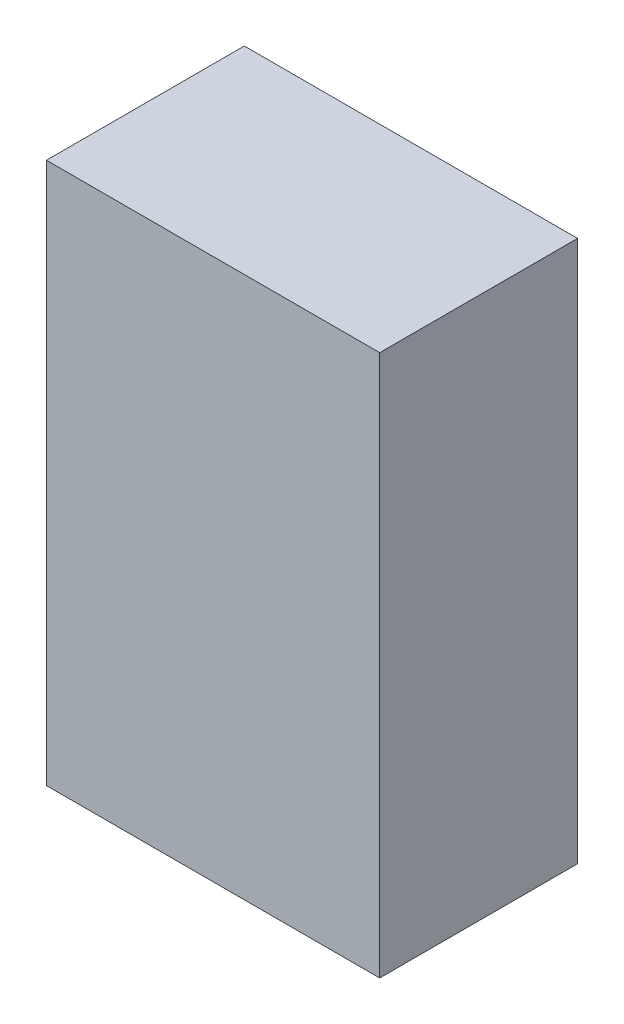
ISO-10303-21;
HEADER;
FILE_DESCRIPTION(('STEP AP214'),'2;1');
FILE_NAME('part.step','',(''),(''),'','','');
FILE_SCHEMA(('AUTOMOTIVE_DESIGN { 1 0 10303 214 1 1 1 1 }'));
ENDSEC;
DATA;
#1=APPLICATION_CONTEXT('core data for automotive mechanical design processes');
#2=APPLICATION_PROTOCOL_DEFINITION('international standard','automotive_design',2000,#1);
#3=PRODUCT_CONTEXT('',#1,'mechanical');
#4=PRODUCT('Part','Part','',(#3));
#5=PRODUCT_RELATED_PRODUCT_CATEGORY('part','',(#4));
#6=PRODUCT_DEFINITION_FORMATION('','',#4);
#7=PRODUCT_DEFINITION_CONTEXT('part definition',#1,'design');
#8=PRODUCT_DEFINITION('design','',#6,#7);
#9=PRODUCT_DEFINITION_SHAPE('','',#8);
#10=(LENGTH_UNIT() NAMED_UNIT(*) SI_UNIT(.MILLI.,.METRE.));
#11=(NAMED_UNIT(*) PLANE_ANGLE_UNIT() SI_UNIT($,.RADIAN.));
#12=(NAMED_UNIT(*) SI_UNIT($,.STERADIAN.) SOLID_ANGLE_UNIT());
#13=UNCERTAINTY_MEASURE_WITH_UNIT(LENGTH_MEASURE(1.E-05),#10,'distance_accuracy_value','');
#14=(GEOMETRIC_REPRESENTATION_CONTEXT(3) GLOBAL_UNCERTAINTY_ASSIGNED_CONTEXT((#13)) GLOBAL_UNIT_ASSIGNED_CONTEXT((#10,
#11,#12)) REPRESENTATION_CONTEXT('',''));
#15=CARTESIAN_POINT('',(0.,0.,0.));
#16=DIRECTION('',(0.,0.,1.));
#17=DIRECTION('',(1.,0.,0.));
#18=AXIS2_PLACEMENT_3D('',#15,#16,#17);
#19=CARTESIAN_POINT('',(0.,0.,19.));
#20=DIRECTION('',(1.,0.,0.));
#21=DIRECTION('',(0.,0.,-1.));
#22=AXIS2_PLACEMENT_3D('',#19,#20,#21);
#23=PLANE('',#22);
#24=DIRECTION('',(0.,-1.,0.));
#25=VECTOR('',#24,1.);
#26=CARTESIAN_POINT('',(0.,0.,0.));
#27=LINE('',#26,#25);
#28=CARTESIAN_POINT('',(0.,0.,0.));
#29=VERTEX_POINT('',#28);
#30=CARTESIAN_POINT('',(0.,-52.,0.));
#31=VERTEX_POINT('',#30);
#32=EDGE_CURVE('E111',#29,#31,#27,.T.);
#33=ORIENTED_EDGE('',*,*,#32,.T.);
#34=DIRECTION('',(0.,0.,-1.));
#35=VECTOR('',#34,1.);
#36=CARTESIAN_POINT('',(0.,-52.,19.));
#37=LINE('',#36,#35);
#38=CARTESIAN_POINT('',(0.,-52.,19.));
#39=VERTEX_POINT('',#38);
#40=EDGE_CURVE('E11',#39,#31,#37,.T.);
#41=ORIENTED_EDGE('',*,*,#40,.F.);
#42=DIRECTION('',(0.,-1.,0.));
#43=VECTOR('',#42,1.);
#44=CARTESIAN_POINT('',(0.,0.,19.));
#45=LINE('',#44,#43);
#46=CARTESIAN_POINT('',(0.,0.,19.));
#47=VERTEX_POINT('',#46);
#48=EDGE_CURVE('E95',#47,#39,#45,.T.);
#49=ORIENTED_EDGE('',*,*,#48,.F.);
#50=DIRECTION('',(0.,0.,-1.));
#51=VECTOR('',#50,1.);
#52=CARTESIAN_POINT('',(0.,0.,19.));
#53=LINE('',#52,#51);
#54=EDGE_CURVE('E107',#47,#29,#53,.T.);
#55=ORIENTED_EDGE('',*,*,#54,.T.);
#56=EDGE_LOOP('',(#33,#41,#49,#55));
#57=FACE_BOUND('',#56,.T.);
#58=ADVANCED_FACE('F43',(#57),#23,.F.);
#59=CARTESIAN_POINT('',(0.,-52.,19.));
#60=DIRECTION('',(0.,1.,0.));
#61=DIRECTION('',(-1.,0.,0.));
#62=AXIS2_PLACEMENT_3D('',#59,#60,#61);
#63=PLANE('',#62);
#64=DIRECTION('',(1.,0.,0.));
#65=VECTOR('',#64,1.);
#66=CARTESIAN_POINT('',(0.,-52.,0.));
#67=LINE('',#66,#65);
#68=CARTESIAN_POINT('',(32.,-52.,0.));
#69=VERTEX_POINT('',#68);
#70=EDGE_CURVE('E100',#31,#69,#67,.T.);
#71=ORIENTED_EDGE('',*,*,#70,.T.);
#72=DIRECTION('',(0.,0.,-1.));
#73=VECTOR('',#72,1.);
#74=CARTESIAN_POINT('',(32.,-52.,19.));
#75=LINE('',#74,#73);
#76=CARTESIAN_POINT('',(32.,-52.,19.));
#77=VERTEX_POINT('',#76);
#78=EDGE_CURVE('E52',#77,#69,#75,.T.);
#79=ORIENTED_EDGE('',*,*,#78,.F.);
#80=DIRECTION('',(1.,0.,0.));
#81=VECTOR('',#80,1.);
#82=CARTESIAN_POINT('',(0.,-52.,19.));
#83=LINE('',#82,#81);
#84=EDGE_CURVE('E90',#39,#77,#83,.T.);
#85=ORIENTED_EDGE('',*,*,#84,.F.);
#86=ORIENTED_EDGE('',*,*,#40,.T.);
#87=EDGE_LOOP('',(#71,#79,#85,#86));
#88=FACE_BOUND('',#87,.T.);
#89=ADVANCED_FACE('F99',(#88),#63,.F.);
#90=CARTESIAN_POINT('',(32.,0.,19.));
#91=DIRECTION('',(-1.,0.,0.));
#92=DIRECTION('',(0.,0.,1.));
#93=AXIS2_PLACEMENT_3D('',#90,#91,#92);
#94=PLANE('',#93);
#95=DIRECTION('',(0.,1.,0.));
#96=VECTOR('',#95,1.);
#97=CARTESIAN_POINT('',(32.,0.,0.));
#98=LINE('',#97,#96);
#99=CARTESIAN_POINT('',(32.,0.,0.));
#100=VERTEX_POINT('',#99);
#101=EDGE_CURVE('E77',#69,#100,#98,.T.);
#102=ORIENTED_EDGE('',*,*,#101,.T.);
#103=DIRECTION('',(0.,0.,-1.));
#104=VECTOR('',#103,1.);
#105=CARTESIAN_POINT('',(32.,0.,19.));
#106=LINE('',#105,#104);
#107=CARTESIAN_POINT('',(32.,0.,19.));
#108=VERTEX_POINT('',#107);
#109=EDGE_CURVE('E102',#108,#100,#106,.T.);
#110=ORIENTED_EDGE('',*,*,#109,.F.);
#111=DIRECTION('',(0.,1.,0.));
#112=VECTOR('',#111,1.);
#113=CARTESIAN_POINT('',(32.,0.,19.));
#114=LINE('',#113,#112);
#115=EDGE_CURVE('E93',#77,#108,#114,.T.);
#116=ORIENTED_EDGE('',*,*,#115,.F.);
#117=ORIENTED_EDGE('',*,*,#78,.T.);
#118=EDGE_LOOP('',(#102,#110,#116,#117));
#119=FACE_BOUND('',#118,.T.);
#120=ADVANCED_FACE('F103',(#119),#94,.F.);
#121=CARTESIAN_POINT('',(0.,0.,19.));
#122=DIRECTION('',(0.,-1.,0.));
#123=DIRECTION('',(0.,0.,-1.));
#124=AXIS2_PLACEMENT_3D('',#121,#122,#123);
#125=PLANE('',#124);
#126=DIRECTION('',(-1.,0.,0.));
#127=VECTOR('',#126,1.);
#128=CARTESIAN_POINT('',(0.,0.,0.));
#129=LINE('',#128,#127);
#130=EDGE_CURVE('E83',#100,#29,#129,.T.);
#131=ORIENTED_EDGE('',*,*,#130,.T.);
#132=ORIENTED_EDGE('',*,*,#54,.F.);
#133=DIRECTION('',(-1.,0.,0.));
#134=VECTOR('',#133,1.);
#135=CARTESIAN_POINT('',(0.,0.,19.));
#136=LINE('',#135,#134);
#137=EDGE_CURVE('E60',#108,#47,#136,.T.);
#138=ORIENTED_EDGE('',*,*,#137,.F.);
#139=ORIENTED_EDGE('',*,*,#109,.T.);
#140=EDGE_LOOP('',(#131,#132,#138,#139));
#141=FACE_BOUND('',#140,.T.);
#142=ADVANCED_FACE('F124',(#141),#125,.F.);
#143=CARTESIAN_POINT('',(0.,0.,19.));
#144=DIRECTION('',(0.,0.,1.));
#145=DIRECTION('',(1.,0.,0.));
#146=AXIS2_PLACEMENT_3D('',#143,#144,#145);
#147=PLANE('',#146);
#148=ORIENTED_EDGE('',*,*,#48,.T.);
#149=ORIENTED_EDGE('',*,*,#84,.T.);
#150=ORIENTED_EDGE('',*,*,#115,.T.);
#151=ORIENTED_EDGE('',*,*,#137,.T.);
#152=EDGE_LOOP('',(#148,#149,#150,#151));
#153=FACE_BOUND('',#152,.T.);
#154=ADVANCED_FACE('F91',(#153),#147,.T.);
#155=CARTESIAN_POINT('',(0.,0.,0.));
#156=DIRECTION('',(0.,0.,1.));
#157=DIRECTION('',(1.,0.,0.));
#158=AXIS2_PLACEMENT_3D('',#155,#156,#157);
#159=PLANE('',#158);
#160=ORIENTED_EDGE('',*,*,#32,.F.);
#161=ORIENTED_EDGE('',*,*,#130,.F.);
#162=ORIENTED_EDGE('',*,*,#101,.F.);
#163=ORIENTED_EDGE('',*,*,#70,.F.);
#164=EDGE_LOOP('',(#160,#161,#162,#163));
#165=FACE_BOUND('',#164,.T.);
#166=ADVANCED_FACE('F127',(#165),#159,.F.);
#167=CLOSED_SHELL('',(#58,#89,#120,#142,#154,#166));
#168=MANIFOLD_SOLID_BREP('B2',#167);
#169=ADVANCED_BREP_SHAPE_REPRESENTATION('',(#18,#168),#14);
#170=SHAPE_DEFINITION_REPRESENTATION(#9,#169);
ENDSEC;
END-ISO-10303-21;
